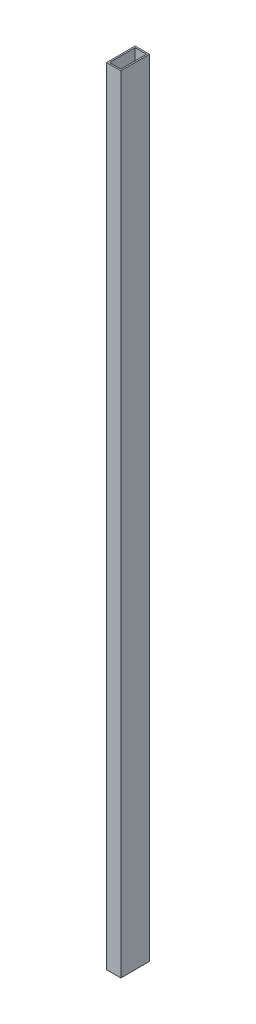
ISO-10303-21;
HEADER;
FILE_DESCRIPTION(('STEP AP214'),'2;1');
FILE_NAME('part.step','',(''),(''),'','','');
FILE_SCHEMA(('AUTOMOTIVE_DESIGN { 1 0 10303 214 1 1 1 1 }'));
ENDSEC;
DATA;
#1=APPLICATION_CONTEXT('core data for automotive mechanical design processes');
#2=APPLICATION_PROTOCOL_DEFINITION('international standard','automotive_design',2000,#1);
#3=PRODUCT_CONTEXT('',#1,'mechanical');
#4=PRODUCT('Part','Part','',(#3));
#5=PRODUCT_RELATED_PRODUCT_CATEGORY('part','',(#4));
#6=PRODUCT_DEFINITION_FORMATION('','',#4);
#7=PRODUCT_DEFINITION_CONTEXT('part definition',#1,'design');
#8=PRODUCT_DEFINITION('design','',#6,#7);
#9=PRODUCT_DEFINITION_SHAPE('','',#8);
#10=(LENGTH_UNIT() NAMED_UNIT(*) SI_UNIT(.MILLI.,.METRE.));
#11=(NAMED_UNIT(*) PLANE_ANGLE_UNIT() SI_UNIT($,.RADIAN.));
#12=(NAMED_UNIT(*) SI_UNIT($,.STERADIAN.) SOLID_ANGLE_UNIT());
#13=UNCERTAINTY_MEASURE_WITH_UNIT(LENGTH_MEASURE(1.E-05),#10,'distance_accuracy_value','');
#14=(GEOMETRIC_REPRESENTATION_CONTEXT(3) GLOBAL_UNCERTAINTY_ASSIGNED_CONTEXT((#13)) GLOBAL_UNIT_ASSIGNED_CONTEXT((#10,
#11,#12)) REPRESENTATION_CONTEXT('',''));
#15=CARTESIAN_POINT('',(0.,0.,0.));
#16=DIRECTION('',(0.,0.,1.));
#17=DIRECTION('',(1.,0.,0.));
#18=AXIS2_PLACEMENT_3D('',#15,#16,#17);
#19=CARTESIAN_POINT('',(0.,1100.,0.));
#20=DIRECTION('',(0.,1.,0.));
#21=DIRECTION('',(0.,0.,1.));
#22=AXIS2_PLACEMENT_3D('',#19,#20,#21);
#23=PLANE('',#22);
#24=DIRECTION('',(0.,0.,-1.));
#25=VECTOR('',#24,1.);
#26=CARTESIAN_POINT('',(9.99999999999999,1100.,-20.));
#27=LINE('',#26,#25);
#28=CARTESIAN_POINT('',(10.,1100.,20.));
#29=VERTEX_POINT('',#28);
#30=CARTESIAN_POINT('',(9.99999999999999,1100.,-20.));
#31=VERTEX_POINT('',#30);
#32=EDGE_CURVE('E159',#29,#31,#27,.T.);
#33=ORIENTED_EDGE('',*,*,#32,.T.);
#34=DIRECTION('',(-1.,0.,0.));
#35=VECTOR('',#34,1.);
#36=CARTESIAN_POINT('',(-10.,1100.,-20.));
#37=LINE('',#36,#35);
#38=CARTESIAN_POINT('',(-10.,1100.,-20.));
#39=VERTEX_POINT('',#38);
#40=EDGE_CURVE('E162',#31,#39,#37,.T.);
#41=ORIENTED_EDGE('',*,*,#40,.T.);
#42=DIRECTION('',(0.,0.,1.));
#43=VECTOR('',#42,1.);
#44=CARTESIAN_POINT('',(-10.,1100.,-20.));
#45=LINE('',#44,#43);
#46=CARTESIAN_POINT('',(-10.,1100.,20.));
#47=VERTEX_POINT('',#46);
#48=EDGE_CURVE('E165',#39,#47,#45,.T.);
#49=ORIENTED_EDGE('',*,*,#48,.T.);
#50=DIRECTION('',(1.,0.,0.));
#51=VECTOR('',#50,1.);
#52=CARTESIAN_POINT('',(-10.,1100.,20.));
#53=LINE('',#52,#51);
#54=EDGE_CURVE('E167',#47,#29,#53,.T.);
#55=ORIENTED_EDGE('',*,*,#54,.T.);
#56=EDGE_LOOP('',(#33,#41,#49,#55));
#57=FACE_BOUND('',#56,.T.);
#58=DIRECTION('',(-1.,0.,0.));
#59=VECTOR('',#58,1.);
#60=CARTESIAN_POINT('',(-10.,1100.,-18.));
#61=LINE('',#60,#59);
#62=CARTESIAN_POINT('',(7.99999999999999,1100.,-18.));
#63=VERTEX_POINT('',#62);
#64=CARTESIAN_POINT('',(-8.00000000000001,1100.,-18.));
#65=VERTEX_POINT('',#64);
#66=EDGE_CURVE('E131',#63,#65,#61,.T.);
#67=ORIENTED_EDGE('',*,*,#66,.F.);
#68=DIRECTION('',(0.,0.,-1.));
#69=VECTOR('',#68,1.);
#70=CARTESIAN_POINT('',(7.99999999999999,1100.,-20.));
#71=LINE('',#70,#69);
#72=CARTESIAN_POINT('',(8.,1100.,18.));
#73=VERTEX_POINT('',#72);
#74=EDGE_CURVE('E123',#73,#63,#71,.T.);
#75=ORIENTED_EDGE('',*,*,#74,.F.);
#76=DIRECTION('',(1.,0.,0.));
#77=VECTOR('',#76,1.);
#78=CARTESIAN_POINT('',(-10.,1100.,18.));
#79=LINE('',#78,#77);
#80=CARTESIAN_POINT('',(-8.,1100.,18.));
#81=VERTEX_POINT('',#80);
#82=EDGE_CURVE('E145',#81,#73,#79,.T.);
#83=ORIENTED_EDGE('',*,*,#82,.F.);
#84=DIRECTION('',(0.,0.,1.));
#85=VECTOR('',#84,1.);
#86=CARTESIAN_POINT('',(-8.00000000000001,1100.,-20.));
#87=LINE('',#86,#85);
#88=EDGE_CURVE('E143',#65,#81,#87,.T.);
#89=ORIENTED_EDGE('',*,*,#88,.F.);
#90=EDGE_LOOP('',(#67,#75,#83,#89));
#91=FACE_BOUND('',#90,.T.);
#92=ADVANCED_FACE('F58',(#57,#91),#23,.T.);
#93=CARTESIAN_POINT('',(0.,0.,0.));
#94=DIRECTION('',(0.,1.,0.));
#95=DIRECTION('',(0.,0.,1.));
#96=AXIS2_PLACEMENT_3D('',#93,#94,#95);
#97=PLANE('',#96);
#98=DIRECTION('',(0.,0.,-1.));
#99=VECTOR('',#98,1.);
#100=CARTESIAN_POINT('',(9.99999999999999,0.,-20.));
#101=LINE('',#100,#99);
#102=CARTESIAN_POINT('',(10.,0.,20.));
#103=VERTEX_POINT('',#102);
#104=CARTESIAN_POINT('',(9.99999999999999,0.,-20.));
#105=VERTEX_POINT('',#104);
#106=EDGE_CURVE('E139',#103,#105,#101,.T.);
#107=ORIENTED_EDGE('',*,*,#106,.F.);
#108=DIRECTION('',(1.,0.,0.));
#109=VECTOR('',#108,1.);
#110=CARTESIAN_POINT('',(-10.,0.,20.));
#111=LINE('',#110,#109);
#112=CARTESIAN_POINT('',(-10.,0.,20.));
#113=VERTEX_POINT('',#112);
#114=EDGE_CURVE('E163',#113,#103,#111,.T.);
#115=ORIENTED_EDGE('',*,*,#114,.F.);
#116=DIRECTION('',(0.,0.,1.));
#117=VECTOR('',#116,1.);
#118=CARTESIAN_POINT('',(-10.,0.,-20.));
#119=LINE('',#118,#117);
#120=CARTESIAN_POINT('',(-10.,0.,-20.));
#121=VERTEX_POINT('',#120);
#122=EDGE_CURVE('E174',#121,#113,#119,.T.);
#123=ORIENTED_EDGE('',*,*,#122,.F.);
#124=DIRECTION('',(-1.,0.,0.));
#125=VECTOR('',#124,1.);
#126=CARTESIAN_POINT('',(-10.,0.,-20.));
#127=LINE('',#126,#125);
#128=EDGE_CURVE('E172',#105,#121,#127,.T.);
#129=ORIENTED_EDGE('',*,*,#128,.F.);
#130=EDGE_LOOP('',(#107,#115,#123,#129));
#131=FACE_BOUND('',#130,.T.);
#132=DIRECTION('',(0.,0.,-1.));
#133=VECTOR('',#132,1.);
#134=CARTESIAN_POINT('',(7.99999999999999,0.,-20.));
#135=LINE('',#134,#133);
#136=CARTESIAN_POINT('',(8.,0.,18.));
#137=VERTEX_POINT('',#136);
#138=CARTESIAN_POINT('',(7.99999999999999,0.,-18.));
#139=VERTEX_POINT('',#138);
#140=EDGE_CURVE('E81',#137,#139,#135,.T.);
#141=ORIENTED_EDGE('',*,*,#140,.T.);
#142=DIRECTION('',(-1.,0.,0.));
#143=VECTOR('',#142,1.);
#144=CARTESIAN_POINT('',(-10.,0.,-18.));
#145=LINE('',#144,#143);
#146=CARTESIAN_POINT('',(-8.00000000000001,0.,-18.));
#147=VERTEX_POINT('',#146);
#148=EDGE_CURVE('E138',#139,#147,#145,.T.);
#149=ORIENTED_EDGE('',*,*,#148,.T.);
#150=DIRECTION('',(0.,0.,1.));
#151=VECTOR('',#150,1.);
#152=CARTESIAN_POINT('',(-8.00000000000001,0.,-20.));
#153=LINE('',#152,#151);
#154=CARTESIAN_POINT('',(-8.,0.,18.));
#155=VERTEX_POINT('',#154);
#156=EDGE_CURVE('E151',#147,#155,#153,.T.);
#157=ORIENTED_EDGE('',*,*,#156,.T.);
#158=DIRECTION('',(1.,0.,0.));
#159=VECTOR('',#158,1.);
#160=CARTESIAN_POINT('',(-10.,0.,18.));
#161=LINE('',#160,#159);
#162=EDGE_CURVE('E132',#155,#137,#161,.T.);
#163=ORIENTED_EDGE('',*,*,#162,.T.);
#164=EDGE_LOOP('',(#141,#149,#157,#163));
#165=FACE_BOUND('',#164,.T.);
#166=ADVANCED_FACE('F192',(#131,#165),#97,.F.);
#167=CARTESIAN_POINT('',(9.99999999999999,1100.,-20.));
#168=DIRECTION('',(-1.,0.,0.));
#169=DIRECTION('',(0.,0.,1.));
#170=AXIS2_PLACEMENT_3D('',#167,#168,#169);
#171=PLANE('',#170);
#172=ORIENTED_EDGE('',*,*,#106,.T.);
#173=DIRECTION('',(0.,-1.,0.));
#174=VECTOR('',#173,1.);
#175=CARTESIAN_POINT('',(9.99999999999999,1100.,-20.));
#176=LINE('',#175,#174);
#177=EDGE_CURVE('E12',#31,#105,#176,.T.);
#178=ORIENTED_EDGE('',*,*,#177,.F.);
#179=ORIENTED_EDGE('',*,*,#32,.F.);
#180=DIRECTION('',(0.,-1.,0.));
#181=VECTOR('',#180,1.);
#182=CARTESIAN_POINT('',(10.,1100.,20.));
#183=LINE('',#182,#181);
#184=EDGE_CURVE('E169',#29,#103,#183,.T.);
#185=ORIENTED_EDGE('',*,*,#184,.T.);
#186=EDGE_LOOP('',(#172,#178,#179,#185));
#187=FACE_BOUND('',#186,.T.);
#188=ADVANCED_FACE('F60',(#187),#171,.F.);
#189=CARTESIAN_POINT('',(-10.,1100.,-20.));
#190=DIRECTION('',(0.,0.,1.));
#191=DIRECTION('',(1.,0.,0.));
#192=AXIS2_PLACEMENT_3D('',#189,#190,#191);
#193=PLANE('',#192);
#194=ORIENTED_EDGE('',*,*,#128,.T.);
#195=DIRECTION('',(0.,-1.,0.));
#196=VECTOR('',#195,1.);
#197=CARTESIAN_POINT('',(-10.,1100.,-20.));
#198=LINE('',#197,#196);
#199=EDGE_CURVE('E66',#39,#121,#198,.T.);
#200=ORIENTED_EDGE('',*,*,#199,.F.);
#201=ORIENTED_EDGE('',*,*,#40,.F.);
#202=ORIENTED_EDGE('',*,*,#177,.T.);
#203=EDGE_LOOP('',(#194,#200,#201,#202));
#204=FACE_BOUND('',#203,.T.);
#205=ADVANCED_FACE('F202',(#204),#193,.F.);
#206=CARTESIAN_POINT('',(-10.,1100.,-20.));
#207=DIRECTION('',(1.,0.,0.));
#208=DIRECTION('',(0.,0.,-1.));
#209=AXIS2_PLACEMENT_3D('',#206,#207,#208);
#210=PLANE('',#209);
#211=ORIENTED_EDGE('',*,*,#122,.T.);
#212=DIRECTION('',(0.,-1.,0.));
#213=VECTOR('',#212,1.);
#214=CARTESIAN_POINT('',(-10.,1100.,20.));
#215=LINE('',#214,#213);
#216=EDGE_CURVE('E179',#47,#113,#215,.T.);
#217=ORIENTED_EDGE('',*,*,#216,.F.);
#218=ORIENTED_EDGE('',*,*,#48,.F.);
#219=ORIENTED_EDGE('',*,*,#199,.T.);
#220=EDGE_LOOP('',(#211,#217,#218,#219));
#221=FACE_BOUND('',#220,.T.);
#222=ADVANCED_FACE('F186',(#221),#210,.F.);
#223=CARTESIAN_POINT('',(-10.,1100.,20.));
#224=DIRECTION('',(0.,0.,-1.));
#225=DIRECTION('',(-1.,0.,0.));
#226=AXIS2_PLACEMENT_3D('',#223,#224,#225);
#227=PLANE('',#226);
#228=ORIENTED_EDGE('',*,*,#114,.T.);
#229=ORIENTED_EDGE('',*,*,#184,.F.);
#230=ORIENTED_EDGE('',*,*,#54,.F.);
#231=ORIENTED_EDGE('',*,*,#216,.T.);
#232=EDGE_LOOP('',(#228,#229,#230,#231));
#233=FACE_BOUND('',#232,.T.);
#234=ADVANCED_FACE('F196',(#233),#227,.F.);
#235=CARTESIAN_POINT('',(7.99999999999999,1100.,-20.));
#236=DIRECTION('',(-1.,0.,0.));
#237=DIRECTION('',(0.,0.,1.));
#238=AXIS2_PLACEMENT_3D('',#235,#236,#237);
#239=PLANE('',#238);
#240=ORIENTED_EDGE('',*,*,#140,.F.);
#241=DIRECTION('',(0.,-1.,0.));
#242=VECTOR('',#241,1.);
#243=CARTESIAN_POINT('',(8.,1100.,18.));
#244=LINE('',#243,#242);
#245=EDGE_CURVE('E127',#73,#137,#244,.T.);
#246=ORIENTED_EDGE('',*,*,#245,.F.);
#247=ORIENTED_EDGE('',*,*,#74,.T.);
#248=DIRECTION('',(0.,-1.,0.));
#249=VECTOR('',#248,1.);
#250=CARTESIAN_POINT('',(7.99999999999999,1100.,-18.));
#251=LINE('',#250,#249);
#252=EDGE_CURVE('E126',#63,#139,#251,.T.);
#253=ORIENTED_EDGE('',*,*,#252,.T.);
#254=EDGE_LOOP('',(#240,#246,#247,#253));
#255=FACE_BOUND('',#254,.T.);
#256=ADVANCED_FACE('F125',(#255),#239,.T.);
#257=CARTESIAN_POINT('',(-10.,1100.,-18.));
#258=DIRECTION('',(0.,0.,1.));
#259=DIRECTION('',(1.,0.,0.));
#260=AXIS2_PLACEMENT_3D('',#257,#258,#259);
#261=PLANE('',#260);
#262=ORIENTED_EDGE('',*,*,#148,.F.);
#263=ORIENTED_EDGE('',*,*,#252,.F.);
#264=ORIENTED_EDGE('',*,*,#66,.T.);
#265=DIRECTION('',(0.,-1.,0.));
#266=VECTOR('',#265,1.);
#267=CARTESIAN_POINT('',(-8.00000000000001,1100.,-18.));
#268=LINE('',#267,#266);
#269=EDGE_CURVE('E140',#65,#147,#268,.T.);
#270=ORIENTED_EDGE('',*,*,#269,.T.);
#271=EDGE_LOOP('',(#262,#263,#264,#270));
#272=FACE_BOUND('',#271,.T.);
#273=ADVANCED_FACE('F135',(#272),#261,.T.);
#274=CARTESIAN_POINT('',(-8.00000000000001,1100.,-20.));
#275=DIRECTION('',(1.,0.,0.));
#276=DIRECTION('',(0.,0.,-1.));
#277=AXIS2_PLACEMENT_3D('',#274,#275,#276);
#278=PLANE('',#277);
#279=ORIENTED_EDGE('',*,*,#156,.F.);
#280=ORIENTED_EDGE('',*,*,#269,.F.);
#281=ORIENTED_EDGE('',*,*,#88,.T.);
#282=DIRECTION('',(0.,-1.,0.));
#283=VECTOR('',#282,1.);
#284=CARTESIAN_POINT('',(-8.,1100.,18.));
#285=LINE('',#284,#283);
#286=EDGE_CURVE('E73',#81,#155,#285,.T.);
#287=ORIENTED_EDGE('',*,*,#286,.T.);
#288=EDGE_LOOP('',(#279,#280,#281,#287));
#289=FACE_BOUND('',#288,.T.);
#290=ADVANCED_FACE('F225',(#289),#278,.T.);
#291=CARTESIAN_POINT('',(-10.,1100.,18.));
#292=DIRECTION('',(0.,0.,-1.));
#293=DIRECTION('',(-1.,0.,0.));
#294=AXIS2_PLACEMENT_3D('',#291,#292,#293);
#295=PLANE('',#294);
#296=ORIENTED_EDGE('',*,*,#162,.F.);
#297=ORIENTED_EDGE('',*,*,#286,.F.);
#298=ORIENTED_EDGE('',*,*,#82,.T.);
#299=ORIENTED_EDGE('',*,*,#245,.T.);
#300=EDGE_LOOP('',(#296,#297,#298,#299));
#301=FACE_BOUND('',#300,.T.);
#302=ADVANCED_FACE('F229',(#301),#295,.T.);
#303=CLOSED_SHELL('',(#92,#166,#188,#205,#222,#234,#256,#273,#290,#302));
#304=MANIFOLD_SOLID_BREP('B2',#303);
#305=ADVANCED_BREP_SHAPE_REPRESENTATION('',(#18,#304),#14);
#306=SHAPE_DEFINITION_REPRESENTATION(#9,#305);
ENDSEC;
END-ISO-10303-21;
